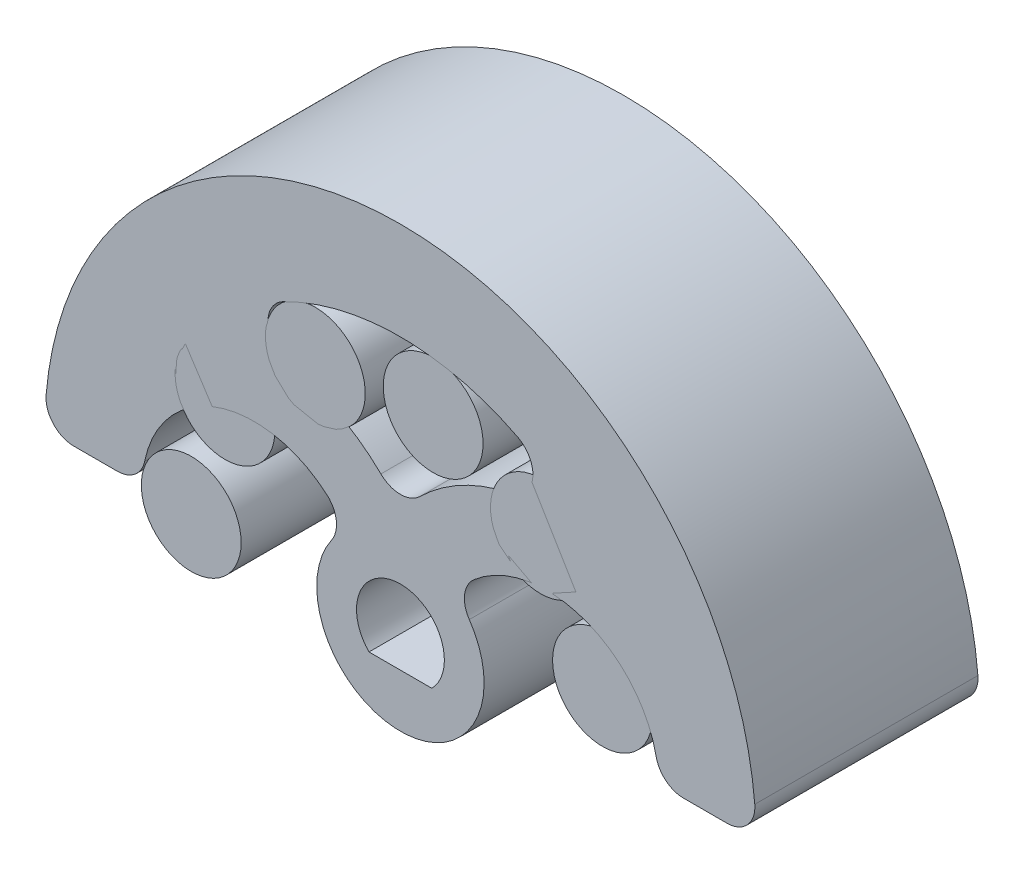
ISO-10303-21;
HEADER;
FILE_DESCRIPTION(('STEP AP214'),'2;1');
FILE_NAME('part.step','',(''),(''),'','','');
FILE_SCHEMA(('AUTOMOTIVE_DESIGN { 1 0 10303 214 1 1 1 1 }'));
ENDSEC;
DATA;
#1=APPLICATION_CONTEXT('core data for automotive mechanical design processes');
#2=APPLICATION_PROTOCOL_DEFINITION('international standard','automotive_design',2000,#1);
#3=PRODUCT_CONTEXT('',#1,'mechanical');
#4=PRODUCT('Part','Part','',(#3));
#5=PRODUCT_RELATED_PRODUCT_CATEGORY('part','',(#4));
#6=PRODUCT_DEFINITION_FORMATION('','',#4);
#7=PRODUCT_DEFINITION_CONTEXT('part definition',#1,'design');
#8=PRODUCT_DEFINITION('design','',#6,#7);
#9=PRODUCT_DEFINITION_SHAPE('','',#8);
#10=(LENGTH_UNIT() NAMED_UNIT(*) SI_UNIT(.MILLI.,.METRE.));
#11=(NAMED_UNIT(*) PLANE_ANGLE_UNIT() SI_UNIT($,.RADIAN.));
#12=(NAMED_UNIT(*) SI_UNIT($,.STERADIAN.) SOLID_ANGLE_UNIT());
#13=UNCERTAINTY_MEASURE_WITH_UNIT(LENGTH_MEASURE(1.E-05),#10,'distance_accuracy_value','');
#14=(GEOMETRIC_REPRESENTATION_CONTEXT(3) GLOBAL_UNCERTAINTY_ASSIGNED_CONTEXT((#13)) GLOBAL_UNIT_ASSIGNED_CONTEXT((#10,
#11,#12)) REPRESENTATION_CONTEXT('',''));
#15=CARTESIAN_POINT('',(0.,0.,0.));
#16=DIRECTION('',(0.,0.,1.));
#17=DIRECTION('',(1.,0.,0.));
#18=AXIS2_PLACEMENT_3D('',#15,#16,#17);
#19=CARTESIAN_POINT('',(7.24444369716802,1.94114283826887,0.));
#20=DIRECTION('',(0.,0.,1.));
#21=DIRECTION('',(-0.96592582628907,-0.258819045102516,0.));
#22=AXIS2_PLACEMENT_3D('',#19,#20,#21);
#23=CYLINDRICAL_SURFACE('',#22,1.78981093410736);
#24=CARTESIAN_POINT('',(7.24444369716802,1.94114283826887,0.));
#25=DIRECTION('',(0.,0.,1.));
#26=DIRECTION('',(-0.96592582628907,-0.258819045102516,0.));
#27=AXIS2_PLACEMENT_3D('',#24,#25,#26);
#28=CIRCLE('',#27,1.78981093410736);
#29=CARTESIAN_POINT('',(5.51561909173915,1.47790568138916,0.));
#30=VERTEX_POINT('',#29);
#31=EDGE_CURVE('P0_E11',#30,#30,#28,.T.);
#32=ORIENTED_EDGE('',*,*,#31,.T.);
#33=EDGE_LOOP('',(#32));
#34=FACE_BOUND('',#33,.T.);
#35=CARTESIAN_POINT('',(7.24444369716802,1.94114283826887,8.));
#36=DIRECTION('',(0.,0.,1.));
#37=DIRECTION('',(-0.96592582628907,-0.258819045102516,0.));
#38=AXIS2_PLACEMENT_3D('',#35,#36,#37);
#39=CIRCLE('',#38,1.78981093410736);
#40=CARTESIAN_POINT('',(5.51561909173915,1.47790568138916,8.));
#41=VERTEX_POINT('',#40);
#42=EDGE_CURVE('P0_E51',#41,#41,#39,.T.);
#43=ORIENTED_EDGE('',*,*,#42,.F.);
#44=EDGE_LOOP('',(#43));
#45=FACE_BOUND('',#44,.T.);
#46=ADVANCED_FACE('P0_F48',(#34,#45),#23,.T.);
#47=CARTESIAN_POINT('',(0.,0.,0.));
#48=DIRECTION('',(0.,0.,1.));
#49=DIRECTION('',(-0.96592582628907,-0.258819045102516,0.));
#50=AXIS2_PLACEMENT_3D('',#47,#48,#49);
#51=PLANE('',#50);
#52=ORIENTED_EDGE('',*,*,#31,.F.);
#53=EDGE_LOOP('',(#52));
#54=FACE_BOUND('',#53,.T.);
#55=ADVANCED_FACE('P0_F63',(#54),#51,.F.);
#56=CARTESIAN_POINT('',(0.,0.,8.));
#57=DIRECTION('',(0.,0.,1.));
#58=DIRECTION('',(-0.96592582628907,-0.258819045102516,0.));
#59=AXIS2_PLACEMENT_3D('',#56,#57,#58);
#60=PLANE('',#59);
#61=ORIENTED_EDGE('',*,*,#42,.T.);
#62=EDGE_LOOP('',(#61));
#63=FACE_BOUND('',#62,.T.);
#64=ADVANCED_FACE('P0_F60',(#63),#60,.T.);
#65=CLOSED_SHELL('',(#46,#55,#64));
#66=MANIFOLD_SOLID_BREP('P0_B2',#65);
#67=CARTESIAN_POINT('',(5.01847954769146,5.57358619108044,0.));
#68=DIRECTION('',(0.,0.,1.));
#69=DIRECTION('',(-0.669130606358861,-0.743144825477392,0.));
#70=AXIS2_PLACEMENT_3D('',#67,#68,#69);
#71=CYLINDRICAL_SURFACE('',#70,1.78981093410736);
#72=CARTESIAN_POINT('',(5.01847954769146,5.57358619108044,0.));
#73=DIRECTION('',(0.,0.,1.));
#74=DIRECTION('',(-0.669130606358861,-0.743144825477392,0.));
#75=AXIS2_PLACEMENT_3D('',#72,#73,#74);
#76=CIRCLE('',#75,1.78981093410736);
#77=CARTESIAN_POINT('',(3.82086227208448,4.24349745681569,0.));
#78=VERTEX_POINT('',#77);
#79=EDGE_CURVE('P0_E47',#78,#78,#76,.T.);
#80=ORIENTED_EDGE('',*,*,#79,.T.);
#81=EDGE_LOOP('',(#80));
#82=FACE_BOUND('',#81,.T.);
#83=CARTESIAN_POINT('',(5.01847954769146,5.57358619108044,8.));
#84=DIRECTION('',(0.,0.,1.));
#85=DIRECTION('',(-0.669130606358861,-0.743144825477392,0.));
#86=AXIS2_PLACEMENT_3D('',#83,#84,#85);
#87=CIRCLE('',#86,1.78981093410736);
#88=CARTESIAN_POINT('',(3.82086227208448,4.24349745681569,8.));
#89=VERTEX_POINT('',#88);
#90=EDGE_CURVE('P0_E122',#89,#89,#87,.T.);
#91=ORIENTED_EDGE('',*,*,#90,.F.);
#92=EDGE_LOOP('',(#91));
#93=FACE_BOUND('',#92,.T.);
#94=ADVANCED_FACE('P0_F119',(#82,#93),#71,.T.);
#95=CARTESIAN_POINT('',(0.,0.,0.));
#96=DIRECTION('',(0.,0.,1.));
#97=DIRECTION('',(-0.669130606358861,-0.743144825477392,0.));
#98=AXIS2_PLACEMENT_3D('',#95,#96,#97);
#99=PLANE('',#98);
#100=ORIENTED_EDGE('',*,*,#79,.F.);
#101=EDGE_LOOP('',(#100));
#102=FACE_BOUND('',#101,.T.);
#103=ADVANCED_FACE('P0_F134',(#102),#99,.F.);
#104=CARTESIAN_POINT('',(0.,0.,8.));
#105=DIRECTION('',(0.,0.,1.));
#106=DIRECTION('',(-0.669130606358861,-0.743144825477392,0.));
#107=AXIS2_PLACEMENT_3D('',#104,#105,#106);
#108=PLANE('',#107);
#109=ORIENTED_EDGE('',*,*,#90,.T.);
#110=EDGE_LOOP('',(#109));
#111=FACE_BOUND('',#110,.T.);
#112=ADVANCED_FACE('P0_F131',(#111),#108,.T.);
#113=CLOSED_SHELL('',(#94,#103,#112));
#114=MANIFOLD_SOLID_BREP('P0_B6',#113);
#115=CARTESIAN_POINT('',(1.17325848780175,7.40766255446353,0.));
#116=DIRECTION('',(0.,0.,1.));
#117=DIRECTION('',(-0.156434465040234,-0.987688340595137,0.));
#118=AXIS2_PLACEMENT_3D('',#115,#116,#117);
#119=CYLINDRICAL_SURFACE('',#118,1.78981093410736);
#120=CARTESIAN_POINT('',(1.17325848780175,7.40766255446353,0.));
#121=DIRECTION('',(0.,0.,1.));
#122=DIRECTION('',(-0.156434465040234,-0.987688340595137,0.));
#123=AXIS2_PLACEMENT_3D('',#120,#121,#122);
#124=CIRCLE('',#123,1.78981093410736);
#125=CARTESIAN_POINT('',(0.893270371801507,5.63988716297599,0.));
#126=VERTEX_POINT('',#125);
#127=EDGE_CURVE('P0_E118',#126,#126,#124,.T.);
#128=ORIENTED_EDGE('',*,*,#127,.T.);
#129=EDGE_LOOP('',(#128));
#130=FACE_BOUND('',#129,.T.);
#131=CARTESIAN_POINT('',(1.17325848780175,7.40766255446353,8.));
#132=DIRECTION('',(0.,0.,1.));
#133=DIRECTION('',(-0.156434465040234,-0.987688340595137,0.));
#134=AXIS2_PLACEMENT_3D('',#131,#132,#133);
#135=CIRCLE('',#134,1.78981093410736);
#136=CARTESIAN_POINT('',(0.893270371801507,5.63988716297599,8.));
#137=VERTEX_POINT('',#136);
#138=EDGE_CURVE('P0_E193',#137,#137,#135,.T.);
#139=ORIENTED_EDGE('',*,*,#138,.F.);
#140=EDGE_LOOP('',(#139));
#141=FACE_BOUND('',#140,.T.);
#142=ADVANCED_FACE('P0_F190',(#130,#141),#119,.T.);
#143=CARTESIAN_POINT('',(0.,0.,0.));
#144=DIRECTION('',(0.,0.,1.));
#145=DIRECTION('',(-0.156434465040234,-0.987688340595137,0.));
#146=AXIS2_PLACEMENT_3D('',#143,#144,#145);
#147=PLANE('',#146);
#148=ORIENTED_EDGE('',*,*,#127,.F.);
#149=EDGE_LOOP('',(#148));
#150=FACE_BOUND('',#149,.T.);
#151=ADVANCED_FACE('P0_F205',(#150),#147,.F.);
#152=CARTESIAN_POINT('',(0.,0.,8.));
#153=DIRECTION('',(0.,0.,1.));
#154=DIRECTION('',(-0.156434465040234,-0.987688340595137,0.));
#155=AXIS2_PLACEMENT_3D('',#152,#153,#154);
#156=PLANE('',#155);
#157=ORIENTED_EDGE('',*,*,#138,.T.);
#158=EDGE_LOOP('',(#157));
#159=FACE_BOUND('',#158,.T.);
#160=ADVANCED_FACE('P0_F202',(#159),#156,.T.);
#161=CLOSED_SHELL('',(#142,#151,#160));
#162=MANIFOLD_SOLID_BREP('P0_B42',#161);
#163=CARTESIAN_POINT('',(-3.05052482306849,6.85159093231951,0.));
#164=DIRECTION('',(0.,0.,1.));
#165=DIRECTION('',(0.406736643075798,-0.913545457642602,0.));
#166=AXIS2_PLACEMENT_3D('',#163,#164,#165);
#167=CYLINDRICAL_SURFACE('',#166,1.78981093410736);
#168=CARTESIAN_POINT('',(-3.05052482306849,6.85159093231951,0.));
#169=DIRECTION('',(0.,0.,1.));
#170=DIRECTION('',(0.406736643075798,-0.913545457642602,0.));
#171=AXIS2_PLACEMENT_3D('',#168,#169,#170);
#172=CIRCLE('',#171,1.78981093410736);
#173=CARTESIAN_POINT('',(-2.3225431319893,5.21651728342667,0.));
#174=VERTEX_POINT('',#173);
#175=EDGE_CURVE('P0_E189',#174,#174,#172,.T.);
#176=ORIENTED_EDGE('',*,*,#175,.T.);
#177=EDGE_LOOP('',(#176));
#178=FACE_BOUND('',#177,.T.);
#179=CARTESIAN_POINT('',(-3.05052482306849,6.85159093231951,8.));
#180=DIRECTION('',(0.,0.,1.));
#181=DIRECTION('',(0.406736643075798,-0.913545457642602,0.));
#182=AXIS2_PLACEMENT_3D('',#179,#180,#181);
#183=CIRCLE('',#182,1.78981093410736);
#184=CARTESIAN_POINT('',(-2.3225431319893,5.21651728342667,8.));
#185=VERTEX_POINT('',#184);
#186=EDGE_CURVE('P0_E264',#185,#185,#183,.T.);
#187=ORIENTED_EDGE('',*,*,#186,.F.);
#188=EDGE_LOOP('',(#187));
#189=FACE_BOUND('',#188,.T.);
#190=ADVANCED_FACE('P0_F261',(#178,#189),#167,.T.);
#191=CARTESIAN_POINT('',(0.,0.,0.));
#192=DIRECTION('',(0.,0.,1.));
#193=DIRECTION('',(0.406736643075798,-0.913545457642602,0.));
#194=AXIS2_PLACEMENT_3D('',#191,#192,#193);
#195=PLANE('',#194);
#196=ORIENTED_EDGE('',*,*,#175,.F.);
#197=EDGE_LOOP('',(#196));
#198=FACE_BOUND('',#197,.T.);
#199=ADVANCED_FACE('P0_F276',(#198),#195,.F.);
#200=CARTESIAN_POINT('',(0.,0.,8.));
#201=DIRECTION('',(0.,0.,1.));
#202=DIRECTION('',(0.406736643075798,-0.913545457642602,0.));
#203=AXIS2_PLACEMENT_3D('',#200,#201,#202);
#204=PLANE('',#203);
#205=ORIENTED_EDGE('',*,*,#186,.T.);
#206=EDGE_LOOP('',(#205));
#207=FACE_BOUND('',#206,.T.);
#208=ADVANCED_FACE('P0_F273',(#207),#204,.T.);
#209=CLOSED_SHELL('',(#190,#199,#208));
#210=MANIFOLD_SOLID_BREP('P0_B113',#209);
#211=CARTESIAN_POINT('',(-6.29002925959068,4.08479276261271,0.));
#212=DIRECTION('',(0.,0.,1.));
#213=DIRECTION('',(0.838670567945423,-0.544639035015028,0.));
#214=AXIS2_PLACEMENT_3D('',#211,#212,#213);
#215=CYLINDRICAL_SURFACE('',#214,1.78981093410736);
#216=CARTESIAN_POINT('',(-6.29002925959068,4.08479276261271,0.));
#217=DIRECTION('',(0.,0.,1.));
#218=DIRECTION('',(0.838670567945423,-0.544639035015028,0.));
#219=AXIS2_PLACEMENT_3D('',#216,#217,#218);
#220=CIRCLE('',#219,1.78981093410736);
#221=CARTESIAN_POINT('',(-4.78896750696792,3.10999186260113,0.));
#222=VERTEX_POINT('',#221);
#223=EDGE_CURVE('P0_E260',#222,#222,#220,.T.);
#224=ORIENTED_EDGE('',*,*,#223,.T.);
#225=EDGE_LOOP('',(#224));
#226=FACE_BOUND('',#225,.T.);
#227=CARTESIAN_POINT('',(-6.29002925959068,4.08479276261271,8.));
#228=DIRECTION('',(0.,0.,1.));
#229=DIRECTION('',(0.838670567945423,-0.544639035015028,0.));
#230=AXIS2_PLACEMENT_3D('',#227,#228,#229);
#231=CIRCLE('',#230,1.78981093410736);
#232=CARTESIAN_POINT('',(-4.78896750696792,3.10999186260113,8.));
#233=VERTEX_POINT('',#232);
#234=EDGE_CURVE('P0_E334',#233,#233,#231,.T.);
#235=ORIENTED_EDGE('',*,*,#234,.F.);
#236=EDGE_LOOP('',(#235));
#237=FACE_BOUND('',#236,.T.);
#238=ADVANCED_FACE('P0_F331',(#226,#237),#215,.T.);
#239=CARTESIAN_POINT('',(0.,0.,0.));
#240=DIRECTION('',(0.,0.,1.));
#241=DIRECTION('',(0.838670567945423,-0.544639035015028,0.));
#242=AXIS2_PLACEMENT_3D('',#239,#240,#241);
#243=PLANE('',#242);
#244=ORIENTED_EDGE('',*,*,#223,.F.);
#245=EDGE_LOOP('',(#244));
#246=FACE_BOUND('',#245,.T.);
#247=ADVANCED_FACE('P0_F346',(#246),#243,.F.);
#248=CARTESIAN_POINT('',(0.,0.,8.));
#249=DIRECTION('',(0.,0.,1.));
#250=DIRECTION('',(0.838670567945423,-0.544639035015028,0.));
#251=AXIS2_PLACEMENT_3D('',#248,#249,#250);
#252=PLANE('',#251);
#253=ORIENTED_EDGE('',*,*,#234,.T.);
#254=EDGE_LOOP('',(#253));
#255=FACE_BOUND('',#254,.T.);
#256=ADVANCED_FACE('P0_F343',(#255),#252,.T.);
#257=CLOSED_SHELL('',(#238,#247,#256));
#258=MANIFOLD_SOLID_BREP('P0_B184',#257);
#259=CARTESIAN_POINT('',(-7.5,0.,0.));
#260=DIRECTION('',(0.,0.,1.));
#261=DIRECTION('',(1.,0.,0.));
#262=AXIS2_PLACEMENT_3D('',#259,#260,#261);
#263=CYLINDRICAL_SURFACE('',#262,1.78981093410736);
#264=CARTESIAN_POINT('',(-7.5,0.,0.));
#265=DIRECTION('',(0.,0.,1.));
#266=DIRECTION('',(1.,0.,0.));
#267=AXIS2_PLACEMENT_3D('',#264,#265,#266);
#268=CIRCLE('',#267,1.78981093410736);
#269=CARTESIAN_POINT('',(-5.71018906589264,0.,0.));
#270=VERTEX_POINT('',#269);
#271=EDGE_CURVE('P0_E330',#270,#270,#268,.T.);
#272=ORIENTED_EDGE('',*,*,#271,.T.);
#273=EDGE_LOOP('',(#272));
#274=FACE_BOUND('',#273,.T.);
#275=CARTESIAN_POINT('',(-7.5,0.,8.));
#276=DIRECTION('',(0.,0.,1.));
#277=DIRECTION('',(1.,0.,0.));
#278=AXIS2_PLACEMENT_3D('',#275,#276,#277);
#279=CIRCLE('',#278,1.78981093410736);
#280=CARTESIAN_POINT('',(-5.71018906589264,0.,8.));
#281=VERTEX_POINT('',#280);
#282=EDGE_CURVE('P0_E397',#281,#281,#279,.T.);
#283=ORIENTED_EDGE('',*,*,#282,.F.);
#284=EDGE_LOOP('',(#283));
#285=FACE_BOUND('',#284,.T.);
#286=ADVANCED_FACE('P0_F394',(#274,#285),#263,.T.);
#287=CARTESIAN_POINT('',(0.,0.,0.));
#288=DIRECTION('',(0.,0.,1.));
#289=DIRECTION('',(1.,0.,0.));
#290=AXIS2_PLACEMENT_3D('',#287,#288,#289);
#291=PLANE('',#290);
#292=ORIENTED_EDGE('',*,*,#271,.F.);
#293=EDGE_LOOP('',(#292));
#294=FACE_BOUND('',#293,.T.);
#295=ADVANCED_FACE('P0_F409',(#294),#291,.F.);
#296=CARTESIAN_POINT('',(0.,0.,8.));
#297=DIRECTION('',(0.,0.,1.));
#298=DIRECTION('',(1.,0.,0.));
#299=AXIS2_PLACEMENT_3D('',#296,#297,#298);
#300=PLANE('',#299);
#301=ORIENTED_EDGE('',*,*,#282,.T.);
#302=EDGE_LOOP('',(#301));
#303=FACE_BOUND('',#302,.T.);
#304=ADVANCED_FACE('P0_F406',(#303),#300,.T.);
#305=CLOSED_SHELL('',(#286,#295,#304));
#306=MANIFOLD_SOLID_BREP('P0_B255',#305);
#307=CARTESIAN_POINT('',(11.7073694739681,1.,8.));
#308=DIRECTION('',(0.,0.,1.));
#309=DIRECTION('',(1.,0.,0.));
#310=AXIS2_PLACEMENT_3D('',#307,#308,#309);
#311=CYLINDRICAL_SURFACE('',#310,1.);
#312=CARTESIAN_POINT('',(11.7073694739681,1.,8.));
#313=DIRECTION('',(0.,0.,-1.));
#314=DIRECTION('',(0.,-1.,0.));
#315=AXIS2_PLACEMENT_3D('',#312,#313,#314);
#316=CIRCLE('',#315,1.);
#317=CARTESIAN_POINT('',(12.703741344093,1.08510638297872,8.));
#318=VERTEX_POINT('',#317);
#319=CARTESIAN_POINT('',(11.7073694739681,0.,8.));
#320=VERTEX_POINT('',#319);
#321=EDGE_CURVE('P1_E11',#318,#320,#316,.T.);
#322=ORIENTED_EDGE('',*,*,#321,.T.);
#323=DIRECTION('',(0.,0.,-1.));
#324=VECTOR('',#323,1.);
#325=CARTESIAN_POINT('',(11.7073694739681,0.,8.));
#326=LINE('',#325,#324);
#327=CARTESIAN_POINT('',(11.7073694739681,0.,0.));
#328=VERTEX_POINT('',#327);
#329=EDGE_CURVE('P1_E26',#320,#328,#326,.T.);
#330=ORIENTED_EDGE('',*,*,#329,.T.);
#331=CARTESIAN_POINT('',(11.7073694739681,1.,0.));
#332=DIRECTION('',(0.,0.,1.));
#333=DIRECTION('',(1.,0.,0.));
#334=AXIS2_PLACEMENT_3D('',#331,#332,#333);
#335=CIRCLE('',#334,1.);
#336=CARTESIAN_POINT('',(12.703741344093,1.08510638297872,0.));
#337=VERTEX_POINT('',#336);
#338=EDGE_CURVE('P1_E324',#328,#337,#335,.T.);
#339=ORIENTED_EDGE('',*,*,#338,.T.);
#340=DIRECTION('',(0.,0.,1.));
#341=VECTOR('',#340,1.);
#342=CARTESIAN_POINT('',(12.703741344093,1.08510638297872,8.));
#343=LINE('',#342,#341);
#344=EDGE_CURVE('P1_E325',#337,#318,#343,.T.);
#345=ORIENTED_EDGE('',*,*,#344,.T.);
#346=EDGE_LOOP('',(#322,#330,#339,#345));
#347=FACE_BOUND('',#346,.T.);
#348=ADVANCED_FACE('P1_F16',(#347),#311,.T.);
#349=CARTESIAN_POINT('',(0.,0.,8.));
#350=DIRECTION('',(0.,0.,-1.));
#351=DIRECTION('',(0.,-1.,0.));
#352=AXIS2_PLACEMENT_3D('',#349,#350,#351);
#353=CYLINDRICAL_SURFACE('',#352,12.75);
#354=ORIENTED_EDGE('',*,*,#344,.F.);
#355=CARTESIAN_POINT('',(0.,0.,0.));
#356=DIRECTION('',(0.,0.,-1.));
#357=DIRECTION('',(0.,-1.,0.));
#358=AXIS2_PLACEMENT_3D('',#355,#356,#357);
#359=CIRCLE('',#358,12.75);
#360=CARTESIAN_POINT('',(-12.703741344093,1.08510638297872,0.));
#361=VERTEX_POINT('',#360);
#362=EDGE_CURVE('P1_E207',#361,#337,#359,.T.);
#363=ORIENTED_EDGE('',*,*,#362,.F.);
#364=DIRECTION('',(0.,0.,-1.));
#365=VECTOR('',#364,1.);
#366=CARTESIAN_POINT('',(-12.703741344093,1.08510638297872,8.));
#367=LINE('',#366,#365);
#368=CARTESIAN_POINT('',(-12.703741344093,1.08510638297872,8.));
#369=VERTEX_POINT('',#368);
#370=EDGE_CURVE('P1_E242',#369,#361,#367,.T.);
#371=ORIENTED_EDGE('',*,*,#370,.F.);
#372=CARTESIAN_POINT('',(0.,0.,8.));
#373=DIRECTION('',(0.,0.,1.));
#374=DIRECTION('',(0.,-1.,0.));
#375=AXIS2_PLACEMENT_3D('',#372,#373,#374);
#376=CIRCLE('',#375,12.75);
#377=EDGE_CURVE('P1_E303',#318,#369,#376,.T.);
#378=ORIENTED_EDGE('',*,*,#377,.F.);
#379=EDGE_LOOP('',(#354,#363,#371,#378));
#380=FACE_BOUND('',#379,.T.);
#381=ADVANCED_FACE('P1_F337',(#380),#353,.T.);
#382=CARTESIAN_POINT('',(0.,0.,0.));
#383=DIRECTION('',(0.,0.,1.));
#384=DIRECTION('',(1.,0.,0.));
#385=AXIS2_PLACEMENT_3D('',#382,#383,#384);
#386=PLANE('',#385);
#387=ORIENTED_EDGE('',*,*,#338,.F.);
#388=DIRECTION('',(-1.,0.,0.));
#389=VECTOR('',#388,1.);
#390=CARTESIAN_POINT('',(9.25,0.,0.));
#391=LINE('',#390,#389);
#392=CARTESIAN_POINT('',(10.1489794855664,0.,0.));
#393=VERTEX_POINT('',#392);
#394=EDGE_CURVE('P1_E182',#328,#393,#391,.T.);
#395=ORIENTED_EDGE('',*,*,#394,.T.);
#396=CARTESIAN_POINT('',(10.1489794855664,1.,0.));
#397=DIRECTION('',(0.,0.,1.));
#398=DIRECTION('',(1.,0.,0.));
#399=AXIS2_PLACEMENT_3D('',#396,#397,#398);
#400=CIRCLE('',#399,1.);
#401=CARTESIAN_POINT('',(9.16918358845309,0.800000000000001,0.));
#402=VERTEX_POINT('',#401);
#403=EDGE_CURVE('P1_E173',#402,#393,#400,.T.);
#404=ORIENTED_EDGE('',*,*,#403,.F.);
#405=CARTESIAN_POINT('',(5.25,0.,0.));
#406=DIRECTION('',(0.,0.,1.));
#407=DIRECTION('',(1.,0.,0.));
#408=AXIS2_PLACEMENT_3D('',#405,#406,#407);
#409=CIRCLE('',#408,4.);
#410=CARTESIAN_POINT('',(2.63888888888889,3.03019780962103,0.));
#411=VERTEX_POINT('',#410);
#412=EDGE_CURVE('P1_E184',#402,#411,#409,.T.);
#413=ORIENTED_EDGE('',*,*,#412,.T.);
#414=CARTESIAN_POINT('',(3.29166666666667,2.27264835721577,0.));
#415=DIRECTION('',(0.,0.,-1.));
#416=DIRECTION('',(0.,-1.,0.));
#417=AXIS2_PLACEMENT_3D('',#414,#415,#416);
#418=CIRCLE('',#417,1.);
#419=CARTESIAN_POINT('',(2.46875,1.70448626791183,0.));
#420=VERTEX_POINT('',#419);
#421=EDGE_CURVE('P1_E188',#420,#411,#418,.T.);
#422=ORIENTED_EDGE('',*,*,#421,.F.);
#423=CARTESIAN_POINT('',(0.,0.,0.));
#424=DIRECTION('',(0.,0.,-1.));
#425=DIRECTION('',(0.,-1.,0.));
#426=AXIS2_PLACEMENT_3D('',#423,#424,#425);
#427=CIRCLE('',#426,3.);
#428=CARTESIAN_POINT('',(-2.46875,1.70448626791183,0.));
#429=VERTEX_POINT('',#428);
#430=EDGE_CURVE('P1_E187',#420,#429,#427,.T.);
#431=ORIENTED_EDGE('',*,*,#430,.T.);
#432=CARTESIAN_POINT('',(-3.29166666666667,2.27264835721577,0.));
#433=DIRECTION('',(0.,0.,-1.));
#434=DIRECTION('',(0.,-1.,0.));
#435=AXIS2_PLACEMENT_3D('',#432,#433,#434);
#436=CIRCLE('',#435,1.);
#437=CARTESIAN_POINT('',(-2.63888888888889,3.03019780962103,0.));
#438=VERTEX_POINT('',#437);
#439=EDGE_CURVE('P1_E195',#438,#429,#436,.T.);
#440=ORIENTED_EDGE('',*,*,#439,.F.);
#441=CARTESIAN_POINT('',(-5.25,0.,0.));
#442=DIRECTION('',(0.,0.,1.));
#443=DIRECTION('',(1.,0.,0.));
#444=AXIS2_PLACEMENT_3D('',#441,#442,#443);
#445=CIRCLE('',#444,4.);
#446=CARTESIAN_POINT('',(-9.16918358845309,0.8,0.));
#447=VERTEX_POINT('',#446);
#448=EDGE_CURVE('P1_E194',#438,#447,#445,.T.);
#449=ORIENTED_EDGE('',*,*,#448,.T.);
#450=CARTESIAN_POINT('',(-10.1489794855664,1.,0.));
#451=DIRECTION('',(0.,0.,1.));
#452=DIRECTION('',(1.,0.,0.));
#453=AXIS2_PLACEMENT_3D('',#450,#451,#452);
#454=CIRCLE('',#453,1.);
#455=CARTESIAN_POINT('',(-10.1489794855664,0.,0.));
#456=VERTEX_POINT('',#455);
#457=EDGE_CURVE('P1_E201',#456,#447,#454,.T.);
#458=ORIENTED_EDGE('',*,*,#457,.F.);
#459=DIRECTION('',(-1.,0.,0.));
#460=VECTOR('',#459,1.);
#461=CARTESIAN_POINT('',(-11.75,0.,0.));
#462=LINE('',#461,#460);
#463=CARTESIAN_POINT('',(-11.7073694739681,0.,0.));
#464=VERTEX_POINT('',#463);
#465=EDGE_CURVE('P1_E200',#456,#464,#462,.T.);
#466=ORIENTED_EDGE('',*,*,#465,.T.);
#467=CARTESIAN_POINT('',(-11.7073694739681,0.999999999999999,0.));
#468=DIRECTION('',(0.,0.,1.));
#469=DIRECTION('',(1.,0.,0.));
#470=AXIS2_PLACEMENT_3D('',#467,#468,#469);
#471=CIRCLE('',#470,1.);
#472=EDGE_CURVE('P1_E208',#361,#464,#471,.T.);
#473=ORIENTED_EDGE('',*,*,#472,.F.);
#474=ORIENTED_EDGE('',*,*,#362,.T.);
#475=EDGE_LOOP('',(#387,#395,#404,#413,#422,#431,#440,#449,#458,#466,#473,#474));
#476=FACE_BOUND('',#475,.T.);
#477=CARTESIAN_POINT('',(5.25,0.,0.));
#478=DIRECTION('',(0.,0.,-1.));
#479=DIRECTION('',(0.,-1.,0.));
#480=AXIS2_PLACEMENT_3D('',#477,#478,#479);
#481=CIRCLE('',#480,6.5);
#482=CARTESIAN_POINT('',(0.700000000000001,4.64192847855285,0.));
#483=VERTEX_POINT('',#482);
#484=CARTESIAN_POINT('',(3.95,6.36867333123626,0.));
#485=VERTEX_POINT('',#484);
#486=EDGE_CURVE('P1_E212',#483,#485,#481,.T.);
#487=ORIENTED_EDGE('',*,*,#486,.T.);
#488=CARTESIAN_POINT('',(3.75,7.34846922834953,0.));
#489=DIRECTION('',(0.,0.,-1.));
#490=DIRECTION('',(0.,-1.,0.));
#491=AXIS2_PLACEMENT_3D('',#488,#489,#490);
#492=CIRCLE('',#491,1.);
#493=CARTESIAN_POINT('',(4.20454545454546,8.23919277117978,0.));
#494=VERTEX_POINT('',#493);
#495=EDGE_CURVE('P1_E216',#494,#485,#492,.T.);
#496=ORIENTED_EDGE('',*,*,#495,.F.);
#497=CARTESIAN_POINT('',(0.,0.,0.));
#498=DIRECTION('',(0.,0.,1.));
#499=DIRECTION('',(1.,0.,0.));
#500=AXIS2_PLACEMENT_3D('',#497,#498,#499);
#501=CIRCLE('',#500,9.25);
#502=CARTESIAN_POINT('',(-4.20454545454546,8.23919277117978,0.));
#503=VERTEX_POINT('',#502);
#504=EDGE_CURVE('P1_E215',#494,#503,#501,.T.);
#505=ORIENTED_EDGE('',*,*,#504,.T.);
#506=CARTESIAN_POINT('',(-3.75,7.34846922834953,0.));
#507=DIRECTION('',(0.,0.,-1.));
#508=DIRECTION('',(0.,-1.,0.));
#509=AXIS2_PLACEMENT_3D('',#506,#507,#508);
#510=CIRCLE('',#509,1.);
#511=CARTESIAN_POINT('',(-3.95,6.36867333123626,0.));
#512=VERTEX_POINT('',#511);
#513=EDGE_CURVE('P1_E223',#512,#503,#510,.T.);
#514=ORIENTED_EDGE('',*,*,#513,.F.);
#515=CARTESIAN_POINT('',(-5.25,0.,0.));
#516=DIRECTION('',(0.,0.,-1.));
#517=DIRECTION('',(0.,-1.,0.));
#518=AXIS2_PLACEMENT_3D('',#515,#516,#517);
#519=CIRCLE('',#518,6.5);
#520=CARTESIAN_POINT('',(-0.7,4.64192847855285,0.));
#521=VERTEX_POINT('',#520);
#522=EDGE_CURVE('P1_E222',#512,#521,#519,.T.);
#523=ORIENTED_EDGE('',*,*,#522,.T.);
#524=CARTESIAN_POINT('',(0.,5.35607132140714,0.));
#525=DIRECTION('',(0.,0.,-1.));
#526=DIRECTION('',(0.,-1.,0.));
#527=AXIS2_PLACEMENT_3D('',#524,#525,#526);
#528=CIRCLE('',#527,1.);
#529=EDGE_CURVE('P1_E230',#483,#521,#528,.T.);
#530=ORIENTED_EDGE('',*,*,#529,.F.);
#531=EDGE_LOOP('',(#487,#496,#505,#514,#523,#530));
#532=FACE_BOUND('',#531,.T.);
#533=CARTESIAN_POINT('',(0.,0.,0.));
#534=DIRECTION('',(0.,0.,1.));
#535=DIRECTION('',(1.,0.,0.));
#536=AXIS2_PLACEMENT_3D('',#533,#534,#535);
#537=CIRCLE('',#536,1.575);
#538=CARTESIAN_POINT('',(1.12722003175955,-1.1,0.));
#539=VERTEX_POINT('',#538);
#540=CARTESIAN_POINT('',(-1.12722003175955,-1.1,0.));
#541=VERTEX_POINT('',#540);
#542=EDGE_CURVE('P1_E229',#539,#541,#537,.T.);
#543=ORIENTED_EDGE('',*,*,#542,.T.);
#544=DIRECTION('',(1.,0.,0.));
#545=VECTOR('',#544,1.);
#546=CARTESIAN_POINT('',(1.12722003175955,-1.1,0.));
#547=LINE('',#546,#545);
#548=EDGE_CURVE('P1_E210',#541,#539,#547,.T.);
#549=ORIENTED_EDGE('',*,*,#548,.T.);
#550=EDGE_LOOP('',(#543,#549));
#551=FACE_BOUND('',#550,.T.);
#552=ADVANCED_FACE('P1_F320',(#476,#532,#551),#386,.F.);
#553=CARTESIAN_POINT('',(-11.7073694739681,0.999999999999999,8.));
#554=DIRECTION('',(0.,0.,-1.));
#555=DIRECTION('',(0.,-1.,0.));
#556=AXIS2_PLACEMENT_3D('',#553,#554,#555);
#557=CYLINDRICAL_SURFACE('',#556,1.);
#558=ORIENTED_EDGE('',*,*,#472,.T.);
#559=DIRECTION('',(0.,0.,1.));
#560=VECTOR('',#559,1.);
#561=CARTESIAN_POINT('',(-11.7073694739681,0.,8.));
#562=LINE('',#561,#560);
#563=CARTESIAN_POINT('',(-11.7073694739681,0.,8.));
#564=VERTEX_POINT('',#563);
#565=EDGE_CURVE('P1_E211',#464,#564,#562,.T.);
#566=ORIENTED_EDGE('',*,*,#565,.T.);
#567=CARTESIAN_POINT('',(-11.7073694739681,0.999999999999999,8.));
#568=DIRECTION('',(0.,0.,-1.));
#569=DIRECTION('',(0.,-1.,0.));
#570=AXIS2_PLACEMENT_3D('',#567,#568,#569);
#571=CIRCLE('',#570,1.);
#572=EDGE_CURVE('P1_E239',#564,#369,#571,.T.);
#573=ORIENTED_EDGE('',*,*,#572,.T.);
#574=ORIENTED_EDGE('',*,*,#370,.T.);
#575=EDGE_LOOP('',(#558,#566,#573,#574));
#576=FACE_BOUND('',#575,.T.);
#577=ADVANCED_FACE('P1_F340',(#576),#557,.T.);
#578=CARTESIAN_POINT('',(-1.12722003175955,-1.1,8.));
#579=DIRECTION('',(0.,1.,0.));
#580=DIRECTION('',(0.,0.,1.));
#581=AXIS2_PLACEMENT_3D('',#578,#579,#580);
#582=PLANE('',#581);
#583=DIRECTION('',(-1.,0.,0.));
#584=VECTOR('',#583,1.);
#585=CARTESIAN_POINT('',(1.12722003175955,-1.1,8.));
#586=LINE('',#585,#584);
#587=CARTESIAN_POINT('',(1.12722003175955,-1.1,8.));
#588=VERTEX_POINT('',#587);
#589=CARTESIAN_POINT('',(-1.12722003175955,-1.1,8.));
#590=VERTEX_POINT('',#589);
#591=EDGE_CURVE('P1_E243',#588,#590,#586,.T.);
#592=ORIENTED_EDGE('',*,*,#591,.F.);
#593=DIRECTION('',(0.,0.,1.));
#594=VECTOR('',#593,1.);
#595=CARTESIAN_POINT('',(1.12722003175955,-1.1,0.));
#596=LINE('',#595,#594);
#597=EDGE_CURVE('P1_E246',#539,#588,#596,.T.);
#598=ORIENTED_EDGE('',*,*,#597,.F.);
#599=ORIENTED_EDGE('',*,*,#548,.F.);
#600=DIRECTION('',(0.,0.,-1.));
#601=VECTOR('',#600,1.);
#602=CARTESIAN_POINT('',(-1.12722003175955,-1.1,0.));
#603=LINE('',#602,#601);
#604=EDGE_CURVE('P1_E249',#590,#541,#603,.T.);
#605=ORIENTED_EDGE('',*,*,#604,.F.);
#606=EDGE_LOOP('',(#592,#598,#599,#605));
#607=FACE_BOUND('',#606,.T.);
#608=ADVANCED_FACE('P1_F381',(#607),#582,.T.);
#609=CARTESIAN_POINT('',(0.,0.,0.));
#610=DIRECTION('',(0.,0.,1.));
#611=DIRECTION('',(1.,0.,0.));
#612=AXIS2_PLACEMENT_3D('',#609,#610,#611);
#613=CYLINDRICAL_SURFACE('',#612,1.575);
#614=ORIENTED_EDGE('',*,*,#597,.T.);
#615=CARTESIAN_POINT('',(0.,0.,8.));
#616=DIRECTION('',(0.,0.,-1.));
#617=DIRECTION('',(0.,-1.,0.));
#618=AXIS2_PLACEMENT_3D('',#615,#616,#617);
#619=CIRCLE('',#618,1.575);
#620=EDGE_CURVE('P1_E171',#590,#588,#619,.T.);
#621=ORIENTED_EDGE('',*,*,#620,.F.);
#622=ORIENTED_EDGE('',*,*,#604,.T.);
#623=ORIENTED_EDGE('',*,*,#542,.F.);
#624=EDGE_LOOP('',(#614,#621,#622,#623));
#625=FACE_BOUND('',#624,.T.);
#626=ADVANCED_FACE('P1_F378',(#625),#613,.F.);
#627=CARTESIAN_POINT('',(3.75,7.34846922834953,8.));
#628=DIRECTION('',(0.,0.,-1.));
#629=DIRECTION('',(0.,-1.,0.));
#630=AXIS2_PLACEMENT_3D('',#627,#628,#629);
#631=CYLINDRICAL_SURFACE('',#630,1.);
#632=CARTESIAN_POINT('',(3.75,7.34846922834953,8.));
#633=DIRECTION('',(0.,0.,1.));
#634=DIRECTION('',(1.,0.,0.));
#635=AXIS2_PLACEMENT_3D('',#632,#633,#634);
#636=CIRCLE('',#635,1.);
#637=CARTESIAN_POINT('',(3.95,6.36867333123626,8.));
#638=VERTEX_POINT('',#637);
#639=CARTESIAN_POINT('',(4.20454545454546,8.23919277117978,8.));
#640=VERTEX_POINT('',#639);
#641=EDGE_CURVE('P1_E252',#638,#640,#636,.T.);
#642=ORIENTED_EDGE('',*,*,#641,.T.);
#643=DIRECTION('',(0.,0.,-1.));
#644=VECTOR('',#643,1.);
#645=CARTESIAN_POINT('',(4.20454545454546,8.23919277117978,8.));
#646=LINE('',#645,#644);
#647=EDGE_CURVE('P1_E218',#640,#494,#646,.T.);
#648=ORIENTED_EDGE('',*,*,#647,.T.);
#649=ORIENTED_EDGE('',*,*,#495,.T.);
#650=DIRECTION('',(0.,0.,1.));
#651=VECTOR('',#650,1.);
#652=CARTESIAN_POINT('',(3.95,6.36867333123626,8.));
#653=LINE('',#652,#651);
#654=EDGE_CURVE('P1_E219',#485,#638,#653,.T.);
#655=ORIENTED_EDGE('',*,*,#654,.T.);
#656=EDGE_LOOP('',(#642,#648,#649,#655));
#657=FACE_BOUND('',#656,.T.);
#658=ADVANCED_FACE('P1_F380',(#657),#631,.F.);
#659=CARTESIAN_POINT('',(0.,0.,8.));
#660=DIRECTION('',(0.,0.,-1.));
#661=DIRECTION('',(0.,-1.,0.));
#662=AXIS2_PLACEMENT_3D('',#659,#660,#661);
#663=CYLINDRICAL_SURFACE('',#662,9.25);
#664=ORIENTED_EDGE('',*,*,#647,.F.);
#665=CARTESIAN_POINT('',(0.,0.,8.));
#666=DIRECTION('',(0.,0.,-1.));
#667=DIRECTION('',(0.,-1.,0.));
#668=AXIS2_PLACEMENT_3D('',#665,#666,#667);
#669=CIRCLE('',#668,9.25);
#670=CARTESIAN_POINT('',(-4.20454545454546,8.23919277117978,8.));
#671=VERTEX_POINT('',#670);
#672=EDGE_CURVE('P1_E175',#671,#640,#669,.T.);
#673=ORIENTED_EDGE('',*,*,#672,.F.);
#674=DIRECTION('',(0.,0.,1.));
#675=VECTOR('',#674,1.);
#676=CARTESIAN_POINT('',(-4.20454545454546,8.23919277117978,8.));
#677=LINE('',#676,#675);
#678=EDGE_CURVE('P1_E226',#503,#671,#677,.T.);
#679=ORIENTED_EDGE('',*,*,#678,.F.);
#680=ORIENTED_EDGE('',*,*,#504,.F.);
#681=EDGE_LOOP('',(#664,#673,#679,#680));
#682=FACE_BOUND('',#681,.T.);
#683=ADVANCED_FACE('P1_F384',(#682),#663,.F.);
#684=CARTESIAN_POINT('',(-3.75,7.34846922834953,8.));
#685=DIRECTION('',(0.,0.,-1.));
#686=DIRECTION('',(0.,-1.,0.));
#687=AXIS2_PLACEMENT_3D('',#684,#685,#686);
#688=CYLINDRICAL_SURFACE('',#687,1.);
#689=CARTESIAN_POINT('',(-3.75,7.34846922834953,8.));
#690=DIRECTION('',(0.,0.,1.));
#691=DIRECTION('',(1.,0.,0.));
#692=AXIS2_PLACEMENT_3D('',#689,#690,#691);
#693=CIRCLE('',#692,1.);
#694=CARTESIAN_POINT('',(-3.95,6.36867333123626,8.));
#695=VERTEX_POINT('',#694);
#696=EDGE_CURVE('P1_E259',#671,#695,#693,.T.);
#697=ORIENTED_EDGE('',*,*,#696,.T.);
#698=DIRECTION('',(0.,0.,-1.));
#699=VECTOR('',#698,1.);
#700=CARTESIAN_POINT('',(-3.95,6.36867333123626,8.));
#701=LINE('',#700,#699);
#702=EDGE_CURVE('P1_E225',#695,#512,#701,.T.);
#703=ORIENTED_EDGE('',*,*,#702,.T.);
#704=ORIENTED_EDGE('',*,*,#513,.T.);
#705=ORIENTED_EDGE('',*,*,#678,.T.);
#706=EDGE_LOOP('',(#697,#703,#704,#705));
#707=FACE_BOUND('',#706,.T.);
#708=ADVANCED_FACE('P1_F376',(#707),#688,.F.);
#709=CARTESIAN_POINT('',(-5.25,0.,8.));
#710=DIRECTION('',(0.,0.,-1.));
#711=DIRECTION('',(0.,-1.,0.));
#712=AXIS2_PLACEMENT_3D('',#709,#710,#711);
#713=CYLINDRICAL_SURFACE('',#712,6.5);
#714=ORIENTED_EDGE('',*,*,#702,.F.);
#715=CARTESIAN_POINT('',(-5.25,0.,8.));
#716=DIRECTION('',(0.,0.,1.));
#717=DIRECTION('',(1.,0.,0.));
#718=AXIS2_PLACEMENT_3D('',#715,#716,#717);
#719=CIRCLE('',#718,6.5);
#720=CARTESIAN_POINT('',(-0.7,4.64192847855285,8.));
#721=VERTEX_POINT('',#720);
#722=EDGE_CURVE('P1_E178',#721,#695,#719,.T.);
#723=ORIENTED_EDGE('',*,*,#722,.F.);
#724=DIRECTION('',(0.,0.,1.));
#725=VECTOR('',#724,1.);
#726=CARTESIAN_POINT('',(-0.7,4.64192847855285,8.));
#727=LINE('',#726,#725);
#728=EDGE_CURVE('P1_E233',#521,#721,#727,.T.);
#729=ORIENTED_EDGE('',*,*,#728,.F.);
#730=ORIENTED_EDGE('',*,*,#522,.F.);
#731=EDGE_LOOP('',(#714,#723,#729,#730));
#732=FACE_BOUND('',#731,.T.);
#733=ADVANCED_FACE('P1_F373',(#732),#713,.T.);
#734=CARTESIAN_POINT('',(0.,5.35607132140714,8.));
#735=DIRECTION('',(0.,0.,-1.));
#736=DIRECTION('',(0.,-1.,0.));
#737=AXIS2_PLACEMENT_3D('',#734,#735,#736);
#738=CYLINDRICAL_SURFACE('',#737,1.);
#739=CARTESIAN_POINT('',(0.,5.35607132140714,8.));
#740=DIRECTION('',(0.,0.,1.));
#741=DIRECTION('',(1.,0.,0.));
#742=AXIS2_PLACEMENT_3D('',#739,#740,#741);
#743=CIRCLE('',#742,1.);
#744=CARTESIAN_POINT('',(0.700000000000001,4.64192847855285,8.));
#745=VERTEX_POINT('',#744);
#746=EDGE_CURVE('P1_E263',#721,#745,#743,.T.);
#747=ORIENTED_EDGE('',*,*,#746,.T.);
#748=DIRECTION('',(0.,0.,-1.));
#749=VECTOR('',#748,1.);
#750=CARTESIAN_POINT('',(0.7,4.64192847855285,8.));
#751=LINE('',#750,#749);
#752=EDGE_CURVE('P1_E232',#745,#483,#751,.T.);
#753=ORIENTED_EDGE('',*,*,#752,.T.);
#754=ORIENTED_EDGE('',*,*,#529,.T.);
#755=ORIENTED_EDGE('',*,*,#728,.T.);
#756=EDGE_LOOP('',(#747,#753,#754,#755));
#757=FACE_BOUND('',#756,.T.);
#758=ADVANCED_FACE('P1_F18',(#757),#738,.F.);
#759=CARTESIAN_POINT('',(5.25,0.,8.));
#760=DIRECTION('',(0.,0.,-1.));
#761=DIRECTION('',(0.,-1.,0.));
#762=AXIS2_PLACEMENT_3D('',#759,#760,#761);
#763=CYLINDRICAL_SURFACE('',#762,6.5);
#764=ORIENTED_EDGE('',*,*,#654,.F.);
#765=ORIENTED_EDGE('',*,*,#486,.F.);
#766=ORIENTED_EDGE('',*,*,#752,.F.);
#767=CARTESIAN_POINT('',(5.25,0.,8.));
#768=DIRECTION('',(0.,0.,1.));
#769=DIRECTION('',(1.,0.,0.));
#770=AXIS2_PLACEMENT_3D('',#767,#768,#769);
#771=CIRCLE('',#770,6.5);
#772=EDGE_CURVE('P1_E245',#638,#745,#771,.T.);
#773=ORIENTED_EDGE('',*,*,#772,.F.);
#774=EDGE_LOOP('',(#764,#765,#766,#773));
#775=FACE_BOUND('',#774,.T.);
#776=ADVANCED_FACE('P1_F353',(#775),#763,.T.);
#777=CARTESIAN_POINT('',(-3.29166666666667,2.27264835721577,0.));
#778=DIRECTION('',(0.,0.,-1.));
#779=DIRECTION('',(0.,-1.,0.));
#780=AXIS2_PLACEMENT_3D('',#777,#778,#779);
#781=CYLINDRICAL_SURFACE('',#780,1.);
#782=CARTESIAN_POINT('',(-3.29166666666667,2.27264835721577,8.));
#783=DIRECTION('',(0.,0.,1.));
#784=DIRECTION('',(1.,0.,0.));
#785=AXIS2_PLACEMENT_3D('',#782,#783,#784);
#786=CIRCLE('',#785,1.);
#787=CARTESIAN_POINT('',(-2.46875,1.70448626791183,8.));
#788=VERTEX_POINT('',#787);
#789=CARTESIAN_POINT('',(-2.63888888888889,3.03019780962103,8.));
#790=VERTEX_POINT('',#789);
#791=EDGE_CURVE('P1_E272',#788,#790,#786,.T.);
#792=ORIENTED_EDGE('',*,*,#791,.T.);
#793=DIRECTION('',(0.,0.,-1.));
#794=VECTOR('',#793,1.);
#795=CARTESIAN_POINT('',(-2.63888888888889,3.03019780962103,0.));
#796=LINE('',#795,#794);
#797=EDGE_CURVE('P1_E197',#790,#438,#796,.T.);
#798=ORIENTED_EDGE('',*,*,#797,.T.);
#799=ORIENTED_EDGE('',*,*,#439,.T.);
#800=DIRECTION('',(0.,0.,1.));
#801=VECTOR('',#800,1.);
#802=CARTESIAN_POINT('',(-2.46875,1.70448626791183,0.));
#803=LINE('',#802,#801);
#804=EDGE_CURVE('P1_E190',#429,#788,#803,.T.);
#805=ORIENTED_EDGE('',*,*,#804,.T.);
#806=EDGE_LOOP('',(#792,#798,#799,#805));
#807=FACE_BOUND('',#806,.T.);
#808=ADVANCED_FACE('P1_F351',(#807),#781,.F.);
#809=CARTESIAN_POINT('',(-5.25,0.,8.));
#810=DIRECTION('',(0.,0.,-1.));
#811=DIRECTION('',(0.,-1.,0.));
#812=AXIS2_PLACEMENT_3D('',#809,#810,#811);
#813=CYLINDRICAL_SURFACE('',#812,4.);
#814=ORIENTED_EDGE('',*,*,#797,.F.);
#815=CARTESIAN_POINT('',(-5.25,0.,8.));
#816=DIRECTION('',(0.,0.,-1.));
#817=DIRECTION('',(0.,-1.,0.));
#818=AXIS2_PLACEMENT_3D('',#815,#816,#817);
#819=CIRCLE('',#818,4.);
#820=CARTESIAN_POINT('',(-9.16918358845309,0.8,8.));
#821=VERTEX_POINT('',#820);
#822=EDGE_CURVE('P1_E284',#821,#790,#819,.T.);
#823=ORIENTED_EDGE('',*,*,#822,.F.);
#824=DIRECTION('',(0.,0.,1.));
#825=VECTOR('',#824,1.);
#826=CARTESIAN_POINT('',(-9.16918358845309,0.8,8.));
#827=LINE('',#826,#825);
#828=EDGE_CURVE('P1_E204',#447,#821,#827,.T.);
#829=ORIENTED_EDGE('',*,*,#828,.F.);
#830=ORIENTED_EDGE('',*,*,#448,.F.);
#831=EDGE_LOOP('',(#814,#823,#829,#830));
#832=FACE_BOUND('',#831,.T.);
#833=ADVANCED_FACE('P1_F349',(#832),#813,.F.);
#834=CARTESIAN_POINT('',(3.29166666666667,2.27264835721577,0.));
#835=DIRECTION('',(0.,0.,1.));
#836=DIRECTION('',(1.,0.,0.));
#837=AXIS2_PLACEMENT_3D('',#834,#835,#836);
#838=CYLINDRICAL_SURFACE('',#837,1.);
#839=ORIENTED_EDGE('',*,*,#421,.T.);
#840=DIRECTION('',(0.,0.,1.));
#841=VECTOR('',#840,1.);
#842=CARTESIAN_POINT('',(2.63888888888889,3.03019780962103,0.));
#843=LINE('',#842,#841);
#844=CARTESIAN_POINT('',(2.63888888888889,3.03019780962103,8.));
#845=VERTEX_POINT('',#844);
#846=EDGE_CURVE('P1_E191',#411,#845,#843,.T.);
#847=ORIENTED_EDGE('',*,*,#846,.T.);
#848=CARTESIAN_POINT('',(3.29166666666667,2.27264835721577,8.));
#849=DIRECTION('',(0.,0.,1.));
#850=DIRECTION('',(1.,0.,0.));
#851=AXIS2_PLACEMENT_3D('',#848,#849,#850);
#852=CIRCLE('',#851,1.);
#853=CARTESIAN_POINT('',(2.46875,1.70448626791183,8.));
#854=VERTEX_POINT('',#853);
#855=EDGE_CURVE('P1_E294',#845,#854,#852,.T.);
#856=ORIENTED_EDGE('',*,*,#855,.T.);
#857=DIRECTION('',(0.,0.,-1.));
#858=VECTOR('',#857,1.);
#859=CARTESIAN_POINT('',(2.46875,1.70448626791183,0.));
#860=LINE('',#859,#858);
#861=EDGE_CURVE('P1_E203',#854,#420,#860,.T.);
#862=ORIENTED_EDGE('',*,*,#861,.T.);
#863=EDGE_LOOP('',(#839,#847,#856,#862));
#864=FACE_BOUND('',#863,.T.);
#865=ADVANCED_FACE('P1_F314',(#864),#838,.F.);
#866=CARTESIAN_POINT('',(5.25,0.,8.));
#867=DIRECTION('',(0.,0.,-1.));
#868=DIRECTION('',(0.,-1.,0.));
#869=AXIS2_PLACEMENT_3D('',#866,#867,#868);
#870=CYLINDRICAL_SURFACE('',#869,4.);
#871=ORIENTED_EDGE('',*,*,#846,.F.);
#872=ORIENTED_EDGE('',*,*,#412,.F.);
#873=DIRECTION('',(0.,0.,-1.));
#874=VECTOR('',#873,1.);
#875=CARTESIAN_POINT('',(9.16918358845309,0.800000000000001,8.));
#876=LINE('',#875,#874);
#877=CARTESIAN_POINT('',(9.16918358845309,0.800000000000001,8.));
#878=VERTEX_POINT('',#877);
#879=EDGE_CURVE('P1_E167',#878,#402,#876,.T.);
#880=ORIENTED_EDGE('',*,*,#879,.F.);
#881=CARTESIAN_POINT('',(5.25,0.,8.));
#882=DIRECTION('',(0.,0.,-1.));
#883=DIRECTION('',(0.,-1.,0.));
#884=AXIS2_PLACEMENT_3D('',#881,#882,#883);
#885=CIRCLE('',#884,4.);
#886=EDGE_CURVE('P1_E163',#845,#878,#885,.T.);
#887=ORIENTED_EDGE('',*,*,#886,.F.);
#888=EDGE_LOOP('',(#871,#872,#880,#887));
#889=FACE_BOUND('',#888,.T.);
#890=ADVANCED_FACE('P1_F318',(#889),#870,.F.);
#891=CARTESIAN_POINT('',(-10.1489794855664,1.,8.));
#892=DIRECTION('',(0.,0.,-1.));
#893=DIRECTION('',(0.,-1.,0.));
#894=AXIS2_PLACEMENT_3D('',#891,#892,#893);
#895=CYLINDRICAL_SURFACE('',#894,1.);
#896=ORIENTED_EDGE('',*,*,#457,.T.);
#897=ORIENTED_EDGE('',*,*,#828,.T.);
#898=CARTESIAN_POINT('',(-10.1489794855664,1.,8.));
#899=DIRECTION('',(0.,0.,-1.));
#900=DIRECTION('',(0.,-1.,0.));
#901=AXIS2_PLACEMENT_3D('',#898,#899,#900);
#902=CIRCLE('',#901,1.);
#903=CARTESIAN_POINT('',(-10.1489794855664,0.,8.));
#904=VERTEX_POINT('',#903);
#905=EDGE_CURVE('P1_E291',#821,#904,#902,.T.);
#906=ORIENTED_EDGE('',*,*,#905,.T.);
#907=DIRECTION('',(0.,0.,-1.));
#908=VECTOR('',#907,1.);
#909=CARTESIAN_POINT('',(-10.1489794855664,0.,8.));
#910=LINE('',#909,#908);
#911=EDGE_CURVE('P1_E150',#904,#456,#910,.T.);
#912=ORIENTED_EDGE('',*,*,#911,.T.);
#913=EDGE_LOOP('',(#896,#897,#906,#912));
#914=FACE_BOUND('',#913,.T.);
#915=ADVANCED_FACE('P1_F345',(#914),#895,.T.);
#916=CARTESIAN_POINT('',(-9.25,0.,8.));
#917=DIRECTION('',(0.,-1.,0.));
#918=DIRECTION('',(0.,0.,-1.));
#919=AXIS2_PLACEMENT_3D('',#916,#917,#918);
#920=PLANE('',#919);
#921=ORIENTED_EDGE('',*,*,#565,.F.);
#922=ORIENTED_EDGE('',*,*,#465,.F.);
#923=ORIENTED_EDGE('',*,*,#911,.F.);
#924=DIRECTION('',(1.,0.,0.));
#925=VECTOR('',#924,1.);
#926=CARTESIAN_POINT('',(-11.75,0.,8.));
#927=LINE('',#926,#925);
#928=EDGE_CURVE('P1_E287',#564,#904,#927,.T.);
#929=ORIENTED_EDGE('',*,*,#928,.F.);
#930=EDGE_LOOP('',(#921,#922,#923,#929));
#931=FACE_BOUND('',#930,.T.);
#932=ADVANCED_FACE('P1_F342',(#931),#920,.T.);
#933=CARTESIAN_POINT('',(0.,0.,8.));
#934=DIRECTION('',(0.,0.,1.));
#935=DIRECTION('',(1.,0.,0.));
#936=AXIS2_PLACEMENT_3D('',#933,#934,#935);
#937=PLANE('',#936);
#938=ORIENTED_EDGE('',*,*,#321,.F.);
#939=ORIENTED_EDGE('',*,*,#377,.T.);
#940=ORIENTED_EDGE('',*,*,#572,.F.);
#941=ORIENTED_EDGE('',*,*,#928,.T.);
#942=ORIENTED_EDGE('',*,*,#905,.F.);
#943=ORIENTED_EDGE('',*,*,#822,.T.);
#944=ORIENTED_EDGE('',*,*,#791,.F.);
#945=CARTESIAN_POINT('',(0.,0.,8.));
#946=DIRECTION('',(0.,0.,1.));
#947=DIRECTION('',(1.,0.,0.));
#948=AXIS2_PLACEMENT_3D('',#945,#946,#947);
#949=CIRCLE('',#948,3.);
#950=EDGE_CURVE('P1_E288',#788,#854,#949,.T.);
#951=ORIENTED_EDGE('',*,*,#950,.T.);
#952=ORIENTED_EDGE('',*,*,#855,.F.);
#953=ORIENTED_EDGE('',*,*,#886,.T.);
#954=CARTESIAN_POINT('',(10.1489794855664,1.,8.));
#955=DIRECTION('',(0.,0.,-1.));
#956=DIRECTION('',(0.,-1.,0.));
#957=AXIS2_PLACEMENT_3D('',#954,#955,#956);
#958=CIRCLE('',#957,1.);
#959=CARTESIAN_POINT('',(10.1489794855664,0.,8.));
#960=VERTEX_POINT('',#959);
#961=EDGE_CURVE('P1_E157',#960,#878,#958,.T.);
#962=ORIENTED_EDGE('',*,*,#961,.F.);
#963=DIRECTION('',(1.,0.,0.));
#964=VECTOR('',#963,1.);
#965=CARTESIAN_POINT('',(9.25,0.,8.));
#966=LINE('',#965,#964);
#967=EDGE_CURVE('P1_E161',#960,#320,#966,.T.);
#968=ORIENTED_EDGE('',*,*,#967,.T.);
#969=EDGE_LOOP('',(#938,#939,#940,#941,#942,#943,#944,#951,#952,#953,#962,#968));
#970=FACE_BOUND('',#969,.T.);
#971=ORIENTED_EDGE('',*,*,#620,.T.);
#972=ORIENTED_EDGE('',*,*,#591,.T.);
#973=EDGE_LOOP('',(#971,#972));
#974=FACE_BOUND('',#973,.T.);
#975=ORIENTED_EDGE('',*,*,#772,.T.);
#976=ORIENTED_EDGE('',*,*,#746,.F.);
#977=ORIENTED_EDGE('',*,*,#722,.T.);
#978=ORIENTED_EDGE('',*,*,#696,.F.);
#979=ORIENTED_EDGE('',*,*,#672,.T.);
#980=ORIENTED_EDGE('',*,*,#641,.F.);
#981=EDGE_LOOP('',(#975,#976,#977,#978,#979,#980));
#982=FACE_BOUND('',#981,.T.);
#983=ADVANCED_FACE('P1_F159',(#970,#974,#982),#937,.T.);
#984=CARTESIAN_POINT('',(10.1489794855664,1.,8.));
#985=DIRECTION('',(0.,0.,-1.));
#986=DIRECTION('',(0.,-1.,0.));
#987=AXIS2_PLACEMENT_3D('',#984,#985,#986);
#988=CYLINDRICAL_SURFACE('',#987,1.);
#989=ORIENTED_EDGE('',*,*,#403,.T.);
#990=DIRECTION('',(0.,0.,1.));
#991=VECTOR('',#990,1.);
#992=CARTESIAN_POINT('',(10.1489794855664,0.,8.));
#993=LINE('',#992,#991);
#994=EDGE_CURVE('P1_E20',#393,#960,#993,.T.);
#995=ORIENTED_EDGE('',*,*,#994,.T.);
#996=ORIENTED_EDGE('',*,*,#961,.T.);
#997=ORIENTED_EDGE('',*,*,#879,.T.);
#998=EDGE_LOOP('',(#989,#995,#996,#997));
#999=FACE_BOUND('',#998,.T.);
#1000=ADVANCED_FACE('P1_F172',(#999),#988,.T.);
#1001=CARTESIAN_POINT('',(-9.25,0.,8.));
#1002=DIRECTION('',(0.,-1.,0.));
#1003=DIRECTION('',(0.,0.,-1.));
#1004=AXIS2_PLACEMENT_3D('',#1001,#1002,#1003);
#1005=PLANE('',#1004);
#1006=ORIENTED_EDGE('',*,*,#329,.F.);
#1007=ORIENTED_EDGE('',*,*,#967,.F.);
#1008=ORIENTED_EDGE('',*,*,#994,.F.);
#1009=ORIENTED_EDGE('',*,*,#394,.F.);
#1010=EDGE_LOOP('',(#1006,#1007,#1008,#1009));
#1011=FACE_BOUND('',#1010,.T.);
#1012=ADVANCED_FACE('P1_F170',(#1011),#1005,.T.);
#1013=CARTESIAN_POINT('',(0.,0.,0.));
#1014=DIRECTION('',(0.,0.,1.));
#1015=DIRECTION('',(1.,0.,0.));
#1016=AXIS2_PLACEMENT_3D('',#1013,#1014,#1015);
#1017=CYLINDRICAL_SURFACE('',#1016,3.);
#1018=ORIENTED_EDGE('',*,*,#804,.F.);
#1019=ORIENTED_EDGE('',*,*,#430,.F.);
#1020=ORIENTED_EDGE('',*,*,#861,.F.);
#1021=ORIENTED_EDGE('',*,*,#950,.F.);
#1022=EDGE_LOOP('',(#1018,#1019,#1020,#1021));
#1023=FACE_BOUND('',#1022,.T.);
#1024=ADVANCED_FACE('P1_F311',(#1023),#1017,.T.);
#1025=CLOSED_SHELL('',(#348,#381,#552,#577,#608,#626,#658,#683,#708,#733,#758,#776,#808,#833,
#865,#890,#915,#932,#983,#1000,#1012,#1024));
#1026=MANIFOLD_SOLID_BREP('P1_B1',#1025);
#1027=ADVANCED_BREP_SHAPE_REPRESENTATION('',(#18,#66,#114,#162,#210,#258,#306,#1026),#14);
#1028=SHAPE_DEFINITION_REPRESENTATION(#9,#1027);
ENDSEC;
END-ISO-10303-21;
